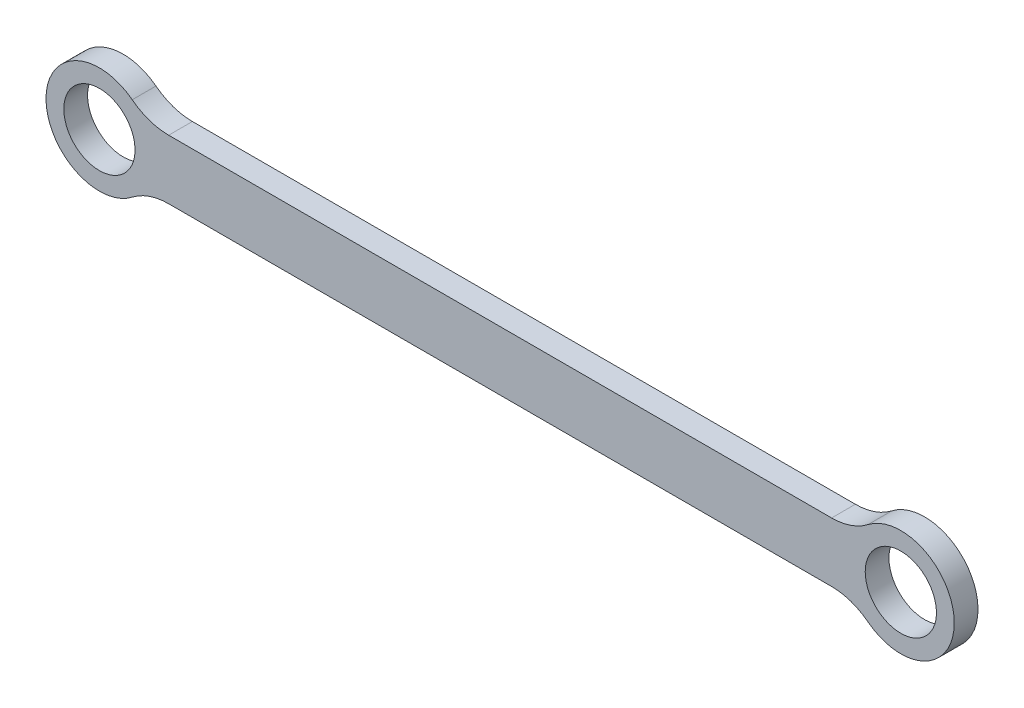
ISO-10303-21;
HEADER;
FILE_DESCRIPTION(('STEP AP214'),'2;1');
FILE_NAME('part.step','',(''),(''),'','','');
FILE_SCHEMA(('AUTOMOTIVE_DESIGN { 1 0 10303 214 1 1 1 1 }'));
ENDSEC;
DATA;
#1=APPLICATION_CONTEXT('core data for automotive mechanical design processes');
#2=APPLICATION_PROTOCOL_DEFINITION('international standard','automotive_design',2000,#1);
#3=PRODUCT_CONTEXT('',#1,'mechanical');
#4=PRODUCT('Part','Part','',(#3));
#5=PRODUCT_RELATED_PRODUCT_CATEGORY('part','',(#4));
#6=PRODUCT_DEFINITION_FORMATION('','',#4);
#7=PRODUCT_DEFINITION_CONTEXT('part definition',#1,'design');
#8=PRODUCT_DEFINITION('design','',#6,#7);
#9=PRODUCT_DEFINITION_SHAPE('','',#8);
#10=(LENGTH_UNIT() NAMED_UNIT(*) SI_UNIT(.MILLI.,.METRE.));
#11=(NAMED_UNIT(*) PLANE_ANGLE_UNIT() SI_UNIT($,.RADIAN.));
#12=(NAMED_UNIT(*) SI_UNIT($,.STERADIAN.) SOLID_ANGLE_UNIT());
#13=UNCERTAINTY_MEASURE_WITH_UNIT(LENGTH_MEASURE(1.E-05),#10,'distance_accuracy_value','');
#14=(GEOMETRIC_REPRESENTATION_CONTEXT(3) GLOBAL_UNCERTAINTY_ASSIGNED_CONTEXT((#13)) GLOBAL_UNIT_ASSIGNED_CONTEXT((#10,
#11,#12)) REPRESENTATION_CONTEXT('',''));
#15=CARTESIAN_POINT('',(0.,0.,0.));
#16=DIRECTION('',(0.,0.,1.));
#17=DIRECTION('',(1.,0.,0.));
#18=AXIS2_PLACEMENT_3D('',#15,#16,#17);
#19=CARTESIAN_POINT('',(123.338096210309,15.,0.));
#20=DIRECTION('',(0.,0.,-1.));
#21=DIRECTION('',(-1.,0.,0.));
#22=AXIS2_PLACEMENT_3D('',#19,#20,#21);
#23=PLANE('',#22);
#24=CARTESIAN_POINT('',(135.,0.,0.));
#25=DIRECTION('',(0.,0.,-1.));
#26=DIRECTION('',(-1.,0.,0.));
#27=AXIS2_PLACEMENT_3D('',#24,#25,#26);
#28=CIRCLE('',#27,6.00000000000001);
#29=CARTESIAN_POINT('',(129.,0.,0.));
#30=VERTEX_POINT('',#29);
#31=EDGE_CURVE('E129',#30,#30,#28,.F.);
#32=ORIENTED_EDGE('',*,*,#31,.T.);
#33=EDGE_LOOP('',(#32));
#34=FACE_BOUND('',#33,.T.);
#35=CARTESIAN_POINT('',(11.6619037896906,15.,0.));
#36=DIRECTION('',(0.,0.,-1.));
#37=DIRECTION('',(-1.,0.,0.));
#38=AXIS2_PLACEMENT_3D('',#35,#36,#37);
#39=CIRCLE('',#38,10.);
#40=CARTESIAN_POINT('',(5.52405968985344,7.10526315789474,0.));
#41=VERTEX_POINT('',#40);
#42=CARTESIAN_POINT('',(11.6619037896906,5.,0.));
#43=VERTEX_POINT('',#42);
#44=EDGE_CURVE('E133',#41,#43,#39,.F.);
#45=ORIENTED_EDGE('',*,*,#44,.T.);
#46=DIRECTION('',(1.,0.,0.));
#47=VECTOR('',#46,1.);
#48=CARTESIAN_POINT('',(11.6619037896906,5.,0.));
#49=LINE('',#48,#47);
#50=CARTESIAN_POINT('',(123.338096210309,5.,0.));
#51=VERTEX_POINT('',#50);
#52=EDGE_CURVE('E105',#43,#51,#49,.T.);
#53=ORIENTED_EDGE('',*,*,#52,.T.);
#54=CARTESIAN_POINT('',(123.338096210309,15.,0.));
#55=DIRECTION('',(0.,0.,-1.));
#56=DIRECTION('',(-1.,0.,0.));
#57=AXIS2_PLACEMENT_3D('',#54,#55,#56);
#58=CIRCLE('',#57,9.99999999999999);
#59=CARTESIAN_POINT('',(129.475940310147,7.10526315789473,0.));
#60=VERTEX_POINT('',#59);
#61=EDGE_CURVE('E85',#51,#60,#58,.F.);
#62=ORIENTED_EDGE('',*,*,#61,.T.);
#63=CARTESIAN_POINT('',(135.,0.,0.));
#64=DIRECTION('',(0.,0.,-1.));
#65=DIRECTION('',(-1.,0.,0.));
#66=AXIS2_PLACEMENT_3D('',#63,#64,#65);
#67=CIRCLE('',#66,9.00000000000001);
#68=CARTESIAN_POINT('',(129.475940310147,-7.10526315789473,0.));
#69=VERTEX_POINT('',#68);
#70=EDGE_CURVE('E80',#69,#60,#67,.F.);
#71=ORIENTED_EDGE('',*,*,#70,.F.);
#72=CARTESIAN_POINT('',(123.338096210309,-15.,0.));
#73=DIRECTION('',(0.,0.,-1.));
#74=DIRECTION('',(-1.,0.,0.));
#75=AXIS2_PLACEMENT_3D('',#72,#73,#74);
#76=CIRCLE('',#75,9.99999999999999);
#77=CARTESIAN_POINT('',(123.338096210309,-5.,0.));
#78=VERTEX_POINT('',#77);
#79=EDGE_CURVE('E83',#69,#78,#76,.F.);
#80=ORIENTED_EDGE('',*,*,#79,.T.);
#81=DIRECTION('',(-1.,0.,0.));
#82=VECTOR('',#81,1.);
#83=CARTESIAN_POINT('',(11.6619037896906,-5.,0.));
#84=LINE('',#83,#82);
#85=CARTESIAN_POINT('',(11.6619037896906,-5.,0.));
#86=VERTEX_POINT('',#85);
#87=EDGE_CURVE('E109',#78,#86,#84,.T.);
#88=ORIENTED_EDGE('',*,*,#87,.T.);
#89=CARTESIAN_POINT('',(11.6619037896906,-15.,0.));
#90=DIRECTION('',(0.,0.,-1.));
#91=DIRECTION('',(-1.,0.,0.));
#92=AXIS2_PLACEMENT_3D('',#89,#90,#91);
#93=CIRCLE('',#92,10.);
#94=CARTESIAN_POINT('',(5.52405968985345,-7.10526315789474,0.));
#95=VERTEX_POINT('',#94);
#96=EDGE_CURVE('E139',#86,#95,#93,.F.);
#97=ORIENTED_EDGE('',*,*,#96,.T.);
#98=CARTESIAN_POINT('',(0.,0.,0.));
#99=DIRECTION('',(0.,0.,-1.));
#100=DIRECTION('',(-1.,0.,0.));
#101=AXIS2_PLACEMENT_3D('',#98,#99,#100);
#102=CIRCLE('',#101,9.);
#103=EDGE_CURVE('E136',#41,#95,#102,.F.);
#104=ORIENTED_EDGE('',*,*,#103,.F.);
#105=EDGE_LOOP('',(#45,#53,#62,#71,#80,#88,#97,#104));
#106=FACE_BOUND('',#105,.T.);
#107=CARTESIAN_POINT('',(0.,0.,0.));
#108=DIRECTION('',(0.,0.,-1.));
#109=DIRECTION('',(-1.,0.,0.));
#110=AXIS2_PLACEMENT_3D('',#107,#108,#109);
#111=CIRCLE('',#110,6.);
#112=CARTESIAN_POINT('',(-6.,0.,0.));
#113=VERTEX_POINT('',#112);
#114=EDGE_CURVE('E20',#113,#113,#111,.F.);
#115=ORIENTED_EDGE('',*,*,#114,.T.);
#116=EDGE_LOOP('',(#115));
#117=FACE_BOUND('',#116,.T.);
#118=ADVANCED_FACE('F17',(#34,#106,#117),#23,.T.);
#119=CARTESIAN_POINT('',(0.,0.,4.));
#120=DIRECTION('',(0.,0.,-1.));
#121=DIRECTION('',(-1.,0.,0.));
#122=AXIS2_PLACEMENT_3D('',#119,#120,#121);
#123=CYLINDRICAL_SURFACE('',#122,6.);
#124=ORIENTED_EDGE('',*,*,#114,.F.);
#125=EDGE_LOOP('',(#124));
#126=FACE_BOUND('',#125,.T.);
#127=CARTESIAN_POINT('',(0.,0.,4.));
#128=DIRECTION('',(0.,0.,-1.));
#129=DIRECTION('',(-1.,0.,0.));
#130=AXIS2_PLACEMENT_3D('',#127,#128,#129);
#131=CIRCLE('',#130,6.);
#132=CARTESIAN_POINT('',(-6.,0.,4.));
#133=VERTEX_POINT('',#132);
#134=EDGE_CURVE('E126',#133,#133,#131,.F.);
#135=ORIENTED_EDGE('',*,*,#134,.T.);
#136=EDGE_LOOP('',(#135));
#137=FACE_BOUND('',#136,.T.);
#138=ADVANCED_FACE('F265',(#126,#137),#123,.F.);
#139=CARTESIAN_POINT('',(135.,0.,4.));
#140=DIRECTION('',(0.,0.,-1.));
#141=DIRECTION('',(-1.,0.,0.));
#142=AXIS2_PLACEMENT_3D('',#139,#140,#141);
#143=CYLINDRICAL_SURFACE('',#142,9.00000000000001);
#144=CARTESIAN_POINT('',(135.,0.,4.));
#145=DIRECTION('',(0.,0.,-1.));
#146=DIRECTION('',(-1.,0.,0.));
#147=AXIS2_PLACEMENT_3D('',#144,#145,#146);
#148=CIRCLE('',#147,9.00000000000001);
#149=CARTESIAN_POINT('',(129.475940310147,7.10526315789473,4.));
#150=VERTEX_POINT('',#149);
#151=CARTESIAN_POINT('',(129.475940310147,-7.10526315789473,4.));
#152=VERTEX_POINT('',#151);
#153=EDGE_CURVE('E100',#150,#152,#148,.T.);
#154=ORIENTED_EDGE('',*,*,#153,.T.);
#155=DIRECTION('',(0.,0.,-1.));
#156=VECTOR('',#155,1.);
#157=CARTESIAN_POINT('',(129.475940310147,-7.10526315789472,4.));
#158=LINE('',#157,#156);
#159=EDGE_CURVE('E90',#152,#69,#158,.T.);
#160=ORIENTED_EDGE('',*,*,#159,.T.);
#161=ORIENTED_EDGE('',*,*,#70,.T.);
#162=DIRECTION('',(0.,0.,-1.));
#163=VECTOR('',#162,1.);
#164=CARTESIAN_POINT('',(129.475940310147,7.10526315789472,4.));
#165=LINE('',#164,#163);
#166=EDGE_CURVE('E107',#60,#150,#165,.F.);
#167=ORIENTED_EDGE('',*,*,#166,.T.);
#168=EDGE_LOOP('',(#154,#160,#161,#167));
#169=FACE_BOUND('',#168,.T.);
#170=ADVANCED_FACE('F99',(#169),#143,.T.);
#171=CARTESIAN_POINT('',(123.338096210309,-15.,4.));
#172=DIRECTION('',(0.,0.,-1.));
#173=DIRECTION('',(-1.,0.,0.));
#174=AXIS2_PLACEMENT_3D('',#171,#172,#173);
#175=CYLINDRICAL_SURFACE('',#174,9.99999999999999);
#176=ORIENTED_EDGE('',*,*,#159,.F.);
#177=CARTESIAN_POINT('',(123.338096210309,-15.,4.));
#178=DIRECTION('',(0.,0.,-1.));
#179=DIRECTION('',(-1.,0.,0.));
#180=AXIS2_PLACEMENT_3D('',#177,#178,#179);
#181=CIRCLE('',#180,9.99999999999999);
#182=CARTESIAN_POINT('',(123.338096210309,-5.,4.));
#183=VERTEX_POINT('',#182);
#184=EDGE_CURVE('E123',#152,#183,#181,.F.);
#185=ORIENTED_EDGE('',*,*,#184,.T.);
#186=DIRECTION('',(0.,0.,1.));
#187=VECTOR('',#186,1.);
#188=CARTESIAN_POINT('',(123.338096210309,-5.,4.));
#189=LINE('',#188,#187);
#190=EDGE_CURVE('E96',#183,#78,#189,.F.);
#191=ORIENTED_EDGE('',*,*,#190,.T.);
#192=ORIENTED_EDGE('',*,*,#79,.F.);
#193=EDGE_LOOP('',(#176,#185,#191,#192));
#194=FACE_BOUND('',#193,.T.);
#195=ADVANCED_FACE('F93',(#194),#175,.F.);
#196=CARTESIAN_POINT('',(11.6619037896906,-5.,4.));
#197=DIRECTION('',(0.,1.,0.));
#198=DIRECTION('',(-1.,0.,0.));
#199=AXIS2_PLACEMENT_3D('',#196,#197,#198);
#200=PLANE('',#199);
#201=ORIENTED_EDGE('',*,*,#190,.F.);
#202=DIRECTION('',(-1.,0.,0.));
#203=VECTOR('',#202,1.);
#204=CARTESIAN_POINT('',(123.338096210309,-5.00000000000001,4.));
#205=LINE('',#204,#203);
#206=CARTESIAN_POINT('',(11.6619037896906,-5.,4.));
#207=VERTEX_POINT('',#206);
#208=EDGE_CURVE('E122',#183,#207,#205,.T.);
#209=ORIENTED_EDGE('',*,*,#208,.T.);
#210=DIRECTION('',(0.,0.,-1.));
#211=VECTOR('',#210,1.);
#212=CARTESIAN_POINT('',(11.6619037896906,-5.,4.));
#213=LINE('',#212,#211);
#214=EDGE_CURVE('E110',#207,#86,#213,.T.);
#215=ORIENTED_EDGE('',*,*,#214,.T.);
#216=ORIENTED_EDGE('',*,*,#87,.F.);
#217=EDGE_LOOP('',(#201,#209,#215,#216));
#218=FACE_BOUND('',#217,.T.);
#219=ADVANCED_FACE('F176',(#218),#200,.F.);
#220=CARTESIAN_POINT('',(11.6619037896906,-15.,4.));
#221=DIRECTION('',(0.,0.,-1.));
#222=DIRECTION('',(-1.,0.,0.));
#223=AXIS2_PLACEMENT_3D('',#220,#221,#222);
#224=CYLINDRICAL_SURFACE('',#223,10.);
#225=ORIENTED_EDGE('',*,*,#214,.F.);
#226=CARTESIAN_POINT('',(11.6619037896906,-15.,4.));
#227=DIRECTION('',(0.,0.,-1.));
#228=DIRECTION('',(-1.,0.,0.));
#229=AXIS2_PLACEMENT_3D('',#226,#227,#228);
#230=CIRCLE('',#229,10.);
#231=CARTESIAN_POINT('',(5.52405968985345,-7.10526315789474,4.));
#232=VERTEX_POINT('',#231);
#233=EDGE_CURVE('E119',#207,#232,#230,.F.);
#234=ORIENTED_EDGE('',*,*,#233,.T.);
#235=DIRECTION('',(0.,0.,-1.));
#236=VECTOR('',#235,1.);
#237=CARTESIAN_POINT('',(5.52405968985345,-7.10526315789474,4.));
#238=LINE('',#237,#236);
#239=EDGE_CURVE('E138',#95,#232,#238,.F.);
#240=ORIENTED_EDGE('',*,*,#239,.F.);
#241=ORIENTED_EDGE('',*,*,#96,.F.);
#242=EDGE_LOOP('',(#225,#234,#240,#241));
#243=FACE_BOUND('',#242,.T.);
#244=ADVANCED_FACE('F174',(#243),#224,.F.);
#245=CARTESIAN_POINT('',(0.,0.,4.));
#246=DIRECTION('',(0.,0.,-1.));
#247=DIRECTION('',(-1.,0.,0.));
#248=AXIS2_PLACEMENT_3D('',#245,#246,#247);
#249=CYLINDRICAL_SURFACE('',#248,9.);
#250=DIRECTION('',(0.,0.,-1.));
#251=VECTOR('',#250,1.);
#252=CARTESIAN_POINT('',(5.52405968985344,7.10526315789474,4.));
#253=LINE('',#252,#251);
#254=CARTESIAN_POINT('',(5.52405968985344,7.10526315789474,4.));
#255=VERTEX_POINT('',#254);
#256=EDGE_CURVE('E135',#255,#41,#253,.T.);
#257=ORIENTED_EDGE('',*,*,#256,.T.);
#258=ORIENTED_EDGE('',*,*,#103,.T.);
#259=ORIENTED_EDGE('',*,*,#239,.T.);
#260=CARTESIAN_POINT('',(0.,0.,4.));
#261=DIRECTION('',(0.,0.,-1.));
#262=DIRECTION('',(-1.,0.,0.));
#263=AXIS2_PLACEMENT_3D('',#260,#261,#262);
#264=CIRCLE('',#263,9.);
#265=EDGE_CURVE('E117',#232,#255,#264,.T.);
#266=ORIENTED_EDGE('',*,*,#265,.T.);
#267=EDGE_LOOP('',(#257,#258,#259,#266));
#268=FACE_BOUND('',#267,.T.);
#269=ADVANCED_FACE('F170',(#268),#249,.T.);
#270=CARTESIAN_POINT('',(11.6619037896906,15.,4.));
#271=DIRECTION('',(0.,0.,-1.));
#272=DIRECTION('',(-1.,0.,0.));
#273=AXIS2_PLACEMENT_3D('',#270,#271,#272);
#274=CYLINDRICAL_SURFACE('',#273,10.);
#275=ORIENTED_EDGE('',*,*,#256,.F.);
#276=CARTESIAN_POINT('',(11.6619037896906,15.,4.));
#277=DIRECTION('',(0.,0.,-1.));
#278=DIRECTION('',(-1.,0.,0.));
#279=AXIS2_PLACEMENT_3D('',#276,#277,#278);
#280=CIRCLE('',#279,10.);
#281=CARTESIAN_POINT('',(11.6619037896906,5.,4.));
#282=VERTEX_POINT('',#281);
#283=EDGE_CURVE('E114',#255,#282,#280,.F.);
#284=ORIENTED_EDGE('',*,*,#283,.T.);
#285=DIRECTION('',(0.,0.,1.));
#286=VECTOR('',#285,1.);
#287=CARTESIAN_POINT('',(11.6619037896906,5.,4.));
#288=LINE('',#287,#286);
#289=EDGE_CURVE('E108',#282,#43,#288,.F.);
#290=ORIENTED_EDGE('',*,*,#289,.T.);
#291=ORIENTED_EDGE('',*,*,#44,.F.);
#292=EDGE_LOOP('',(#275,#284,#290,#291));
#293=FACE_BOUND('',#292,.T.);
#294=ADVANCED_FACE('F167',(#293),#274,.F.);
#295=CARTESIAN_POINT('',(11.6619037896906,5.,4.));
#296=DIRECTION('',(0.,-1.,0.));
#297=DIRECTION('',(1.,0.,0.));
#298=AXIS2_PLACEMENT_3D('',#295,#296,#297);
#299=PLANE('',#298);
#300=ORIENTED_EDGE('',*,*,#289,.F.);
#301=DIRECTION('',(-1.,0.,0.));
#302=VECTOR('',#301,1.);
#303=CARTESIAN_POINT('',(123.338096210309,5.,4.));
#304=LINE('',#303,#302);
#305=CARTESIAN_POINT('',(123.338096210309,5.,4.));
#306=VERTEX_POINT('',#305);
#307=EDGE_CURVE('E113',#282,#306,#304,.F.);
#308=ORIENTED_EDGE('',*,*,#307,.T.);
#309=DIRECTION('',(0.,0.,-1.));
#310=VECTOR('',#309,1.);
#311=CARTESIAN_POINT('',(123.338096210309,5.,4.));
#312=LINE('',#311,#310);
#313=EDGE_CURVE('E35',#306,#51,#312,.T.);
#314=ORIENTED_EDGE('',*,*,#313,.T.);
#315=ORIENTED_EDGE('',*,*,#52,.F.);
#316=EDGE_LOOP('',(#300,#308,#314,#315));
#317=FACE_BOUND('',#316,.T.);
#318=ADVANCED_FACE('F158',(#317),#299,.F.);
#319=CARTESIAN_POINT('',(123.338096210309,15.,4.));
#320=DIRECTION('',(0.,0.,-1.));
#321=DIRECTION('',(-1.,0.,0.));
#322=AXIS2_PLACEMENT_3D('',#319,#320,#321);
#323=CYLINDRICAL_SURFACE('',#322,9.99999999999999);
#324=ORIENTED_EDGE('',*,*,#313,.F.);
#325=CARTESIAN_POINT('',(123.338096210309,15.,4.));
#326=DIRECTION('',(0.,0.,-1.));
#327=DIRECTION('',(-1.,0.,0.));
#328=AXIS2_PLACEMENT_3D('',#325,#326,#327);
#329=CIRCLE('',#328,9.99999999999999);
#330=EDGE_CURVE('E26',#306,#150,#329,.F.);
#331=ORIENTED_EDGE('',*,*,#330,.T.);
#332=ORIENTED_EDGE('',*,*,#166,.F.);
#333=ORIENTED_EDGE('',*,*,#61,.F.);
#334=EDGE_LOOP('',(#324,#331,#332,#333));
#335=FACE_BOUND('',#334,.T.);
#336=ADVANCED_FACE('F192',(#335),#323,.F.);
#337=CARTESIAN_POINT('',(135.,0.,4.));
#338=DIRECTION('',(0.,0.,-1.));
#339=DIRECTION('',(-1.,0.,0.));
#340=AXIS2_PLACEMENT_3D('',#337,#338,#339);
#341=CYLINDRICAL_SURFACE('',#340,6.00000000000001);
#342=ORIENTED_EDGE('',*,*,#31,.F.);
#343=EDGE_LOOP('',(#342));
#344=FACE_BOUND('',#343,.T.);
#345=CARTESIAN_POINT('',(135.,0.,4.));
#346=DIRECTION('',(0.,0.,-1.));
#347=DIRECTION('',(-1.,0.,0.));
#348=AXIS2_PLACEMENT_3D('',#345,#346,#347);
#349=CIRCLE('',#348,6.00000000000001);
#350=CARTESIAN_POINT('',(129.,0.,4.));
#351=VERTEX_POINT('',#350);
#352=EDGE_CURVE('E11',#351,#351,#349,.F.);
#353=ORIENTED_EDGE('',*,*,#352,.T.);
#354=EDGE_LOOP('',(#353));
#355=FACE_BOUND('',#354,.T.);
#356=ADVANCED_FACE('F186',(#344,#355),#341,.F.);
#357=CARTESIAN_POINT('',(123.338096210309,15.,4.));
#358=DIRECTION('',(0.,0.,-1.));
#359=DIRECTION('',(-1.,0.,0.));
#360=AXIS2_PLACEMENT_3D('',#357,#358,#359);
#361=PLANE('',#360);
#362=ORIENTED_EDGE('',*,*,#352,.F.);
#363=EDGE_LOOP('',(#362));
#364=FACE_BOUND('',#363,.T.);
#365=ORIENTED_EDGE('',*,*,#307,.F.);
#366=ORIENTED_EDGE('',*,*,#283,.F.);
#367=ORIENTED_EDGE('',*,*,#265,.F.);
#368=ORIENTED_EDGE('',*,*,#233,.F.);
#369=ORIENTED_EDGE('',*,*,#208,.F.);
#370=ORIENTED_EDGE('',*,*,#184,.F.);
#371=ORIENTED_EDGE('',*,*,#153,.F.);
#372=ORIENTED_EDGE('',*,*,#330,.F.);
#373=EDGE_LOOP('',(#365,#366,#367,#368,#369,#370,#371,#372));
#374=FACE_BOUND('',#373,.T.);
#375=ORIENTED_EDGE('',*,*,#134,.F.);
#376=EDGE_LOOP('',(#375));
#377=FACE_BOUND('',#376,.T.);
#378=ADVANCED_FACE('F162',(#364,#374,#377),#361,.F.);
#379=CLOSED_SHELL('',(#118,#138,#170,#195,#219,#244,#269,#294,#318,#336,#356,#378));
#380=MANIFOLD_SOLID_BREP('B1',#379);
#381=ADVANCED_BREP_SHAPE_REPRESENTATION('',(#18,#380),#14);
#382=SHAPE_DEFINITION_REPRESENTATION(#9,#381);
ENDSEC;
END-ISO-10303-21;
